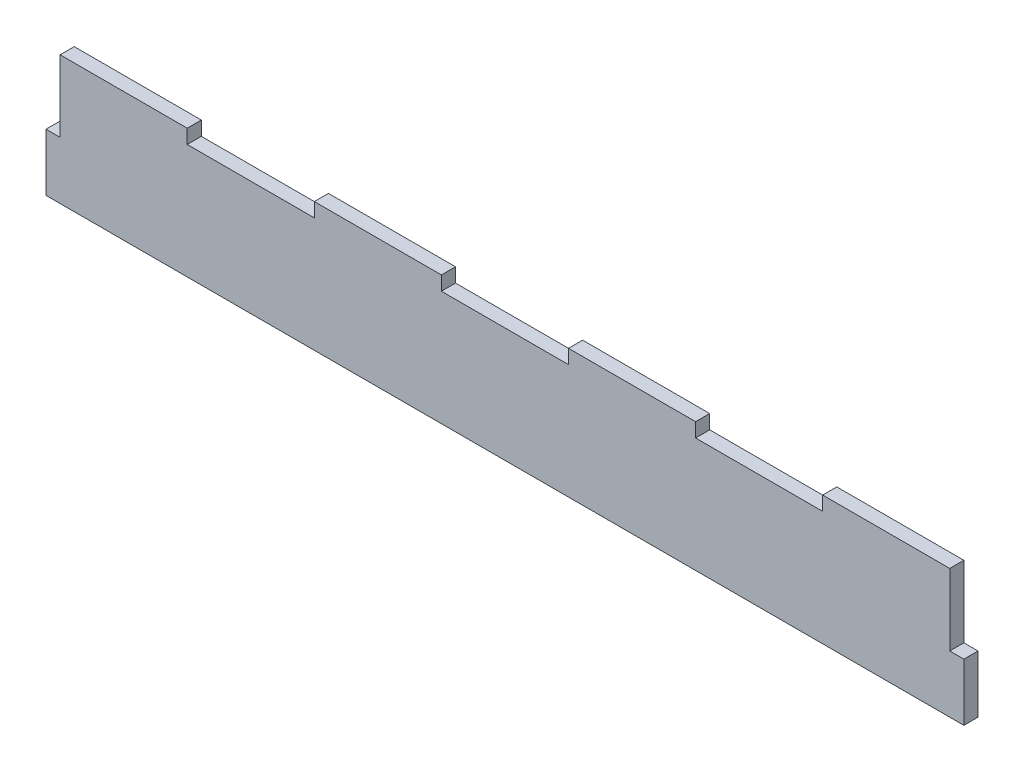
ISO-10303-21;
HEADER;
FILE_DESCRIPTION(('STEP AP214'),'2;1');
FILE_NAME('part.step','',(''),(''),'','','');
FILE_SCHEMA(('AUTOMOTIVE_DESIGN { 1 0 10303 214 1 1 1 1 }'));
ENDSEC;
DATA;
#1=APPLICATION_CONTEXT('core data for automotive mechanical design processes');
#2=APPLICATION_PROTOCOL_DEFINITION('international standard','automotive_design',2000,#1);
#3=PRODUCT_CONTEXT('',#1,'mechanical');
#4=PRODUCT('Part','Part','',(#3));
#5=PRODUCT_RELATED_PRODUCT_CATEGORY('part','',(#4));
#6=PRODUCT_DEFINITION_FORMATION('','',#4);
#7=PRODUCT_DEFINITION_CONTEXT('part definition',#1,'design');
#8=PRODUCT_DEFINITION('design','',#6,#7);
#9=PRODUCT_DEFINITION_SHAPE('','',#8);
#10=(LENGTH_UNIT() NAMED_UNIT(*) SI_UNIT(.MILLI.,.METRE.));
#11=(NAMED_UNIT(*) PLANE_ANGLE_UNIT() SI_UNIT($,.RADIAN.));
#12=(NAMED_UNIT(*) SI_UNIT($,.STERADIAN.) SOLID_ANGLE_UNIT());
#13=UNCERTAINTY_MEASURE_WITH_UNIT(LENGTH_MEASURE(1.E-05),#10,'distance_accuracy_value','');
#14=(GEOMETRIC_REPRESENTATION_CONTEXT(3) GLOBAL_UNCERTAINTY_ASSIGNED_CONTEXT((#13)) GLOBAL_UNIT_ASSIGNED_CONTEXT((#10,
#11,#12)) REPRESENTATION_CONTEXT('',''));
#15=CARTESIAN_POINT('',(0.,0.,0.));
#16=DIRECTION('',(0.,0.,1.));
#17=DIRECTION('',(1.,0.,0.));
#18=AXIS2_PLACEMENT_3D('',#15,#16,#17);
#19=CARTESIAN_POINT('',(0.,-10.16,10.16));
#20=DIRECTION('',(0.,1.,0.));
#21=DIRECTION('',(-1.,0.,0.));
#22=AXIS2_PLACEMENT_3D('',#19,#20,#21);
#23=PLANE('',#22);
#24=DIRECTION('',(1.,0.,0.));
#25=VECTOR('',#24,1.);
#26=CARTESIAN_POINT('',(0.,-10.16,0.));
#27=LINE('',#26,#25);
#28=CARTESIAN_POINT('',(101.6,-10.16,0.));
#29=VERTEX_POINT('',#28);
#30=CARTESIAN_POINT('',(193.04,-10.16,0.));
#31=VERTEX_POINT('',#30);
#32=EDGE_CURVE('E202',#29,#31,#27,.T.);
#33=ORIENTED_EDGE('',*,*,#32,.F.);
#34=DIRECTION('',(0.,0.,-1.));
#35=VECTOR('',#34,1.);
#36=CARTESIAN_POINT('',(101.6,-10.16,10.16));
#37=LINE('',#36,#35);
#38=CARTESIAN_POINT('',(101.6,-10.16,10.16));
#39=VERTEX_POINT('',#38);
#40=EDGE_CURVE('E11',#39,#29,#37,.T.);
#41=ORIENTED_EDGE('',*,*,#40,.F.);
#42=DIRECTION('',(1.,0.,0.));
#43=VECTOR('',#42,1.);
#44=CARTESIAN_POINT('',(0.,-10.16,10.16));
#45=LINE('',#44,#43);
#46=CARTESIAN_POINT('',(193.04,-10.16,10.16));
#47=VERTEX_POINT('',#46);
#48=EDGE_CURVE('E253',#39,#47,#45,.T.);
#49=ORIENTED_EDGE('',*,*,#48,.T.);
#50=DIRECTION('',(0.,0.,-1.));
#51=VECTOR('',#50,1.);
#52=CARTESIAN_POINT('',(193.04,-10.16,10.16));
#53=LINE('',#52,#51);
#54=EDGE_CURVE('E52',#47,#31,#53,.T.);
#55=ORIENTED_EDGE('',*,*,#54,.T.);
#56=EDGE_LOOP('',(#33,#41,#49,#55));
#57=FACE_BOUND('',#56,.T.);
#58=ADVANCED_FACE('F35',(#57),#23,.T.);
#59=CARTESIAN_POINT('',(101.6,0.,10.16));
#60=DIRECTION('',(-1.,0.,0.));
#61=DIRECTION('',(0.,0.,1.));
#62=AXIS2_PLACEMENT_3D('',#59,#60,#61);
#63=PLANE('',#62);
#64=DIRECTION('',(0.,1.,0.));
#65=VECTOR('',#64,1.);
#66=CARTESIAN_POINT('',(101.6,0.,0.));
#67=LINE('',#66,#65);
#68=CARTESIAN_POINT('',(101.6,0.,0.));
#69=VERTEX_POINT('',#68);
#70=EDGE_CURVE('E204',#29,#69,#67,.T.);
#71=ORIENTED_EDGE('',*,*,#70,.T.);
#72=DIRECTION('',(0.,0.,-1.));
#73=VECTOR('',#72,1.);
#74=CARTESIAN_POINT('',(101.6,0.,10.16));
#75=LINE('',#74,#73);
#76=CARTESIAN_POINT('',(101.6,0.,10.16));
#77=VERTEX_POINT('',#76);
#78=EDGE_CURVE('E44',#77,#69,#75,.T.);
#79=ORIENTED_EDGE('',*,*,#78,.F.);
#80=DIRECTION('',(0.,1.,0.));
#81=VECTOR('',#80,1.);
#82=CARTESIAN_POINT('',(101.6,0.,10.16));
#83=LINE('',#82,#81);
#84=EDGE_CURVE('E306',#39,#77,#83,.T.);
#85=ORIENTED_EDGE('',*,*,#84,.F.);
#86=ORIENTED_EDGE('',*,*,#40,.T.);
#87=EDGE_LOOP('',(#71,#79,#85,#86));
#88=FACE_BOUND('',#87,.T.);
#89=ADVANCED_FACE('F37',(#88),#63,.F.);
#90=CARTESIAN_POINT('',(0.,0.,10.16));
#91=DIRECTION('',(0.,1.,0.));
#92=DIRECTION('',(0.,0.,1.));
#93=AXIS2_PLACEMENT_3D('',#90,#91,#92);
#94=PLANE('',#93);
#95=DIRECTION('',(1.,0.,0.));
#96=VECTOR('',#95,1.);
#97=CARTESIAN_POINT('',(0.,0.,0.));
#98=LINE('',#97,#96);
#99=CARTESIAN_POINT('',(10.16,0.,0.));
#100=VERTEX_POINT('',#99);
#101=EDGE_CURVE('E209',#100,#69,#98,.T.);
#102=ORIENTED_EDGE('',*,*,#101,.F.);
#103=DIRECTION('',(0.,0.,-1.));
#104=VECTOR('',#103,1.);
#105=CARTESIAN_POINT('',(10.16,0.,10.16));
#106=LINE('',#105,#104);
#107=CARTESIAN_POINT('',(10.16,0.,10.16));
#108=VERTEX_POINT('',#107);
#109=EDGE_CURVE('E284',#108,#100,#106,.T.);
#110=ORIENTED_EDGE('',*,*,#109,.F.);
#111=DIRECTION('',(1.,0.,0.));
#112=VECTOR('',#111,1.);
#113=CARTESIAN_POINT('',(0.,0.,10.16));
#114=LINE('',#113,#112);
#115=EDGE_CURVE('E291',#108,#77,#114,.T.);
#116=ORIENTED_EDGE('',*,*,#115,.T.);
#117=ORIENTED_EDGE('',*,*,#78,.T.);
#118=EDGE_LOOP('',(#102,#110,#116,#117));
#119=FACE_BOUND('',#118,.T.);
#120=ADVANCED_FACE('F289',(#119),#94,.T.);
#121=CARTESIAN_POINT('',(10.16,0.,10.16));
#122=DIRECTION('',(-1.,0.,0.));
#123=DIRECTION('',(0.,0.,1.));
#124=AXIS2_PLACEMENT_3D('',#121,#122,#123);
#125=PLANE('',#124);
#126=DIRECTION('',(0.,1.,0.));
#127=VECTOR('',#126,1.);
#128=CARTESIAN_POINT('',(10.16,0.,0.));
#129=LINE('',#128,#127);
#130=CARTESIAN_POINT('',(10.16,-51.4350000000001,0.));
#131=VERTEX_POINT('',#130);
#132=EDGE_CURVE('E212',#131,#100,#129,.T.);
#133=ORIENTED_EDGE('',*,*,#132,.F.);
#134=DIRECTION('',(0.,0.,-1.));
#135=VECTOR('',#134,1.);
#136=CARTESIAN_POINT('',(10.16,-51.4350000000001,10.16));
#137=LINE('',#136,#135);
#138=CARTESIAN_POINT('',(10.16,-51.4350000000001,10.16));
#139=VERTEX_POINT('',#138);
#140=EDGE_CURVE('E282',#139,#131,#137,.T.);
#141=ORIENTED_EDGE('',*,*,#140,.F.);
#142=DIRECTION('',(0.,1.,0.));
#143=VECTOR('',#142,1.);
#144=CARTESIAN_POINT('',(10.16,0.,10.16));
#145=LINE('',#144,#143);
#146=EDGE_CURVE('E303',#139,#108,#145,.T.);
#147=ORIENTED_EDGE('',*,*,#146,.T.);
#148=ORIENTED_EDGE('',*,*,#109,.T.);
#149=EDGE_LOOP('',(#133,#141,#147,#148));
#150=FACE_BOUND('',#149,.T.);
#151=ADVANCED_FACE('F300',(#150),#125,.T.);
#152=CARTESIAN_POINT('',(0.,-51.4350000000001,10.16));
#153=DIRECTION('',(0.,1.,0.));
#154=DIRECTION('',(0.,0.,1.));
#155=AXIS2_PLACEMENT_3D('',#152,#153,#154);
#156=PLANE('',#155);
#157=DIRECTION('',(1.,0.,0.));
#158=VECTOR('',#157,1.);
#159=CARTESIAN_POINT('',(0.,-51.4350000000001,0.));
#160=LINE('',#159,#158);
#161=CARTESIAN_POINT('',(0.,-51.4350000000001,0.));
#162=VERTEX_POINT('',#161);
#163=EDGE_CURVE('E215',#162,#131,#160,.T.);
#164=ORIENTED_EDGE('',*,*,#163,.F.);
#165=DIRECTION('',(0.,0.,-1.));
#166=VECTOR('',#165,1.);
#167=CARTESIAN_POINT('',(0.,-51.4350000000001,10.16));
#168=LINE('',#167,#166);
#169=CARTESIAN_POINT('',(0.,-51.4350000000001,10.16));
#170=VERTEX_POINT('',#169);
#171=EDGE_CURVE('E280',#170,#162,#168,.T.);
#172=ORIENTED_EDGE('',*,*,#171,.F.);
#173=DIRECTION('',(1.,0.,0.));
#174=VECTOR('',#173,1.);
#175=CARTESIAN_POINT('',(0.,-51.4350000000001,10.16));
#176=LINE('',#175,#174);
#177=EDGE_CURVE('E308',#170,#139,#176,.T.);
#178=ORIENTED_EDGE('',*,*,#177,.T.);
#179=ORIENTED_EDGE('',*,*,#140,.T.);
#180=EDGE_LOOP('',(#164,#172,#178,#179));
#181=FACE_BOUND('',#180,.T.);
#182=ADVANCED_FACE('F410',(#181),#156,.T.);
#183=CARTESIAN_POINT('',(0.,0.,10.16));
#184=DIRECTION('',(1.,0.,0.));
#185=DIRECTION('',(0.,1.,0.));
#186=AXIS2_PLACEMENT_3D('',#183,#184,#185);
#187=PLANE('',#186);
#188=DIRECTION('',(0.,-1.,0.));
#189=VECTOR('',#188,1.);
#190=CARTESIAN_POINT('',(0.,0.,0.));
#191=LINE('',#190,#189);
#192=CARTESIAN_POINT('',(0.,-92.71,0.));
#193=VERTEX_POINT('',#192);
#194=EDGE_CURVE('E218',#162,#193,#191,.T.);
#195=ORIENTED_EDGE('',*,*,#194,.T.);
#196=DIRECTION('',(0.,0.,-1.));
#197=VECTOR('',#196,1.);
#198=CARTESIAN_POINT('',(0.,-92.71,10.16));
#199=LINE('',#198,#197);
#200=CARTESIAN_POINT('',(0.,-92.71,10.16));
#201=VERTEX_POINT('',#200);
#202=EDGE_CURVE('E277',#201,#193,#199,.T.);
#203=ORIENTED_EDGE('',*,*,#202,.F.);
#204=DIRECTION('',(0.,-1.,0.));
#205=VECTOR('',#204,1.);
#206=CARTESIAN_POINT('',(0.,0.,10.16));
#207=LINE('',#206,#205);
#208=EDGE_CURVE('E314',#170,#201,#207,.T.);
#209=ORIENTED_EDGE('',*,*,#208,.F.);
#210=ORIENTED_EDGE('',*,*,#171,.T.);
#211=EDGE_LOOP('',(#195,#203,#209,#210));
#212=FACE_BOUND('',#211,.T.);
#213=ADVANCED_FACE('F408',(#212),#187,.F.);
#214=CARTESIAN_POINT('',(0.,-92.71,10.16));
#215=DIRECTION('',(0.,1.,0.));
#216=DIRECTION('',(0.,0.,1.));
#217=AXIS2_PLACEMENT_3D('',#214,#215,#216);
#218=PLANE('',#217);
#219=DIRECTION('',(1.,0.,0.));
#220=VECTOR('',#219,1.);
#221=CARTESIAN_POINT('',(0.,-92.71,0.));
#222=LINE('',#221,#220);
#223=CARTESIAN_POINT('',(660.4,-92.71,0.));
#224=VERTEX_POINT('',#223);
#225=EDGE_CURVE('E220',#193,#224,#222,.T.);
#226=ORIENTED_EDGE('',*,*,#225,.T.);
#227=DIRECTION('',(0.,0.,-1.));
#228=VECTOR('',#227,1.);
#229=CARTESIAN_POINT('',(660.4,-92.71,10.16));
#230=LINE('',#229,#228);
#231=CARTESIAN_POINT('',(660.4,-92.71,10.16));
#232=VERTEX_POINT('',#231);
#233=EDGE_CURVE('E275',#232,#224,#230,.T.);
#234=ORIENTED_EDGE('',*,*,#233,.F.);
#235=DIRECTION('',(1.,0.,0.));
#236=VECTOR('',#235,1.);
#237=CARTESIAN_POINT('',(0.,-92.71,10.16));
#238=LINE('',#237,#236);
#239=EDGE_CURVE('E316',#201,#232,#238,.T.);
#240=ORIENTED_EDGE('',*,*,#239,.F.);
#241=ORIENTED_EDGE('',*,*,#202,.T.);
#242=EDGE_LOOP('',(#226,#234,#240,#241));
#243=FACE_BOUND('',#242,.T.);
#244=ADVANCED_FACE('F403',(#243),#218,.F.);
#245=CARTESIAN_POINT('',(660.4,-7.90843798363125E-13,10.16));
#246=DIRECTION('',(1.,0.,0.));
#247=DIRECTION('',(0.,1.,0.));
#248=AXIS2_PLACEMENT_3D('',#245,#246,#247);
#249=PLANE('',#248);
#250=DIRECTION('',(0.,-1.,0.));
#251=VECTOR('',#250,1.);
#252=CARTESIAN_POINT('',(660.4,-7.90843798363125E-13,0.));
#253=LINE('',#252,#251);
#254=CARTESIAN_POINT('',(660.4,-51.435,0.));
#255=VERTEX_POINT('',#254);
#256=EDGE_CURVE('E223',#255,#224,#253,.T.);
#257=ORIENTED_EDGE('',*,*,#256,.F.);
#258=DIRECTION('',(0.,0.,-1.));
#259=VECTOR('',#258,1.);
#260=CARTESIAN_POINT('',(660.4,-51.435,10.16));
#261=LINE('',#260,#259);
#262=CARTESIAN_POINT('',(660.4,-51.435,10.16));
#263=VERTEX_POINT('',#262);
#264=EDGE_CURVE('E273',#263,#255,#261,.T.);
#265=ORIENTED_EDGE('',*,*,#264,.F.);
#266=DIRECTION('',(0.,-1.,0.));
#267=VECTOR('',#266,1.);
#268=CARTESIAN_POINT('',(660.4,-7.90843798363125E-13,10.16));
#269=LINE('',#268,#267);
#270=EDGE_CURVE('E318',#263,#232,#269,.T.);
#271=ORIENTED_EDGE('',*,*,#270,.T.);
#272=ORIENTED_EDGE('',*,*,#233,.T.);
#273=EDGE_LOOP('',(#257,#265,#271,#272));
#274=FACE_BOUND('',#273,.T.);
#275=ADVANCED_FACE('F399',(#274),#249,.T.);
#276=CARTESIAN_POINT('',(0.,-51.4350000000004,10.16));
#277=DIRECTION('',(0.,-1.,0.));
#278=DIRECTION('',(1.,0.,0.));
#279=AXIS2_PLACEMENT_3D('',#276,#277,#278);
#280=PLANE('',#279);
#281=DIRECTION('',(-1.,0.,0.));
#282=VECTOR('',#281,1.);
#283=CARTESIAN_POINT('',(0.,-51.4350000000004,0.));
#284=LINE('',#283,#282);
#285=CARTESIAN_POINT('',(650.24,-51.435,0.));
#286=VERTEX_POINT('',#285);
#287=EDGE_CURVE('E226',#255,#286,#284,.T.);
#288=ORIENTED_EDGE('',*,*,#287,.T.);
#289=DIRECTION('',(0.,0.,-1.));
#290=VECTOR('',#289,1.);
#291=CARTESIAN_POINT('',(650.24,-51.435,10.16));
#292=LINE('',#291,#290);
#293=CARTESIAN_POINT('',(650.24,-51.435,10.16));
#294=VERTEX_POINT('',#293);
#295=EDGE_CURVE('E271',#294,#286,#292,.T.);
#296=ORIENTED_EDGE('',*,*,#295,.F.);
#297=DIRECTION('',(-1.,0.,0.));
#298=VECTOR('',#297,1.);
#299=CARTESIAN_POINT('',(0.,-51.4350000000004,10.16));
#300=LINE('',#299,#298);
#301=EDGE_CURVE('E321',#263,#294,#300,.T.);
#302=ORIENTED_EDGE('',*,*,#301,.F.);
#303=ORIENTED_EDGE('',*,*,#264,.T.);
#304=EDGE_LOOP('',(#288,#296,#302,#303));
#305=FACE_BOUND('',#304,.T.);
#306=ADVANCED_FACE('F396',(#305),#280,.F.);
#307=CARTESIAN_POINT('',(650.24,0.,10.16));
#308=DIRECTION('',(1.,0.,0.));
#309=DIRECTION('',(0.,0.,-1.));
#310=AXIS2_PLACEMENT_3D('',#307,#308,#309);
#311=PLANE('',#310);
#312=DIRECTION('',(0.,-1.,0.));
#313=VECTOR('',#312,1.);
#314=CARTESIAN_POINT('',(650.24,0.,0.));
#315=LINE('',#314,#313);
#316=CARTESIAN_POINT('',(650.24,0.,0.));
#317=VERTEX_POINT('',#316);
#318=EDGE_CURVE('E229',#317,#286,#315,.T.);
#319=ORIENTED_EDGE('',*,*,#318,.F.);
#320=DIRECTION('',(0.,0.,-1.));
#321=VECTOR('',#320,1.);
#322=CARTESIAN_POINT('',(650.24,0.,10.16));
#323=LINE('',#322,#321);
#324=CARTESIAN_POINT('',(650.24,0.,10.16));
#325=VERTEX_POINT('',#324);
#326=EDGE_CURVE('E269',#325,#317,#323,.T.);
#327=ORIENTED_EDGE('',*,*,#326,.F.);
#328=DIRECTION('',(0.,-1.,0.));
#329=VECTOR('',#328,1.);
#330=CARTESIAN_POINT('',(650.24,0.,10.16));
#331=LINE('',#330,#329);
#332=EDGE_CURVE('E323',#325,#294,#331,.T.);
#333=ORIENTED_EDGE('',*,*,#332,.T.);
#334=ORIENTED_EDGE('',*,*,#295,.T.);
#335=EDGE_LOOP('',(#319,#327,#333,#334));
#336=FACE_BOUND('',#335,.T.);
#337=ADVANCED_FACE('F391',(#336),#311,.T.);
#338=CARTESIAN_POINT('',(0.,0.,10.16));
#339=DIRECTION('',(0.,1.,0.));
#340=DIRECTION('',(0.,0.,1.));
#341=AXIS2_PLACEMENT_3D('',#338,#339,#340);
#342=PLANE('',#341);
#343=DIRECTION('',(1.,0.,0.));
#344=VECTOR('',#343,1.);
#345=CARTESIAN_POINT('',(0.,0.,0.));
#346=LINE('',#345,#344);
#347=CARTESIAN_POINT('',(558.8,0.,0.));
#348=VERTEX_POINT('',#347);
#349=EDGE_CURVE('E232',#348,#317,#346,.T.);
#350=ORIENTED_EDGE('',*,*,#349,.F.);
#351=DIRECTION('',(0.,0.,-1.));
#352=VECTOR('',#351,1.);
#353=CARTESIAN_POINT('',(558.8,0.,10.16));
#354=LINE('',#353,#352);
#355=CARTESIAN_POINT('',(558.8,0.,10.16));
#356=VERTEX_POINT('',#355);
#357=EDGE_CURVE('E267',#356,#348,#354,.T.);
#358=ORIENTED_EDGE('',*,*,#357,.F.);
#359=DIRECTION('',(1.,0.,0.));
#360=VECTOR('',#359,1.);
#361=CARTESIAN_POINT('',(0.,0.,10.16));
#362=LINE('',#361,#360);
#363=EDGE_CURVE('E326',#356,#325,#362,.T.);
#364=ORIENTED_EDGE('',*,*,#363,.T.);
#365=ORIENTED_EDGE('',*,*,#326,.T.);
#366=EDGE_LOOP('',(#350,#358,#364,#365));
#367=FACE_BOUND('',#366,.T.);
#368=ADVANCED_FACE('F386',(#367),#342,.T.);
#369=CARTESIAN_POINT('',(558.8,0.,10.16));
#370=DIRECTION('',(1.,0.,0.));
#371=DIRECTION('',(0.,0.,-1.));
#372=AXIS2_PLACEMENT_3D('',#369,#370,#371);
#373=PLANE('',#372);
#374=DIRECTION('',(0.,-1.,0.));
#375=VECTOR('',#374,1.);
#376=CARTESIAN_POINT('',(558.8,0.,0.));
#377=LINE('',#376,#375);
#378=CARTESIAN_POINT('',(558.8,-10.16,0.));
#379=VERTEX_POINT('',#378);
#380=EDGE_CURVE('E235',#348,#379,#377,.T.);
#381=ORIENTED_EDGE('',*,*,#380,.T.);
#382=DIRECTION('',(0.,0.,-1.));
#383=VECTOR('',#382,1.);
#384=CARTESIAN_POINT('',(558.8,-10.16,10.16));
#385=LINE('',#384,#383);
#386=CARTESIAN_POINT('',(558.8,-10.16,10.16));
#387=VERTEX_POINT('',#386);
#388=EDGE_CURVE('E265',#387,#379,#385,.T.);
#389=ORIENTED_EDGE('',*,*,#388,.F.);
#390=DIRECTION('',(0.,-1.,0.));
#391=VECTOR('',#390,1.);
#392=CARTESIAN_POINT('',(558.8,0.,10.16));
#393=LINE('',#392,#391);
#394=EDGE_CURVE('E329',#356,#387,#393,.T.);
#395=ORIENTED_EDGE('',*,*,#394,.F.);
#396=ORIENTED_EDGE('',*,*,#357,.T.);
#397=EDGE_LOOP('',(#381,#389,#395,#396));
#398=FACE_BOUND('',#397,.T.);
#399=ADVANCED_FACE('F362',(#398),#373,.F.);
#400=CARTESIAN_POINT('',(467.36,-10.16,0.));
#401=VERTEX_POINT('',#400);
#402=EDGE_CURVE('E206',#401,#379,#27,.T.);
#403=ORIENTED_EDGE('',*,*,#402,.F.);
#404=DIRECTION('',(0.,0.,-1.));
#405=VECTOR('',#404,1.);
#406=CARTESIAN_POINT('',(467.36,-10.16,10.16));
#407=LINE('',#406,#405);
#408=CARTESIAN_POINT('',(467.36,-10.16,10.16));
#409=VERTEX_POINT('',#408);
#410=EDGE_CURVE('E263',#409,#401,#407,.T.);
#411=ORIENTED_EDGE('',*,*,#410,.F.);
#412=EDGE_CURVE('E331',#409,#387,#45,.T.);
#413=ORIENTED_EDGE('',*,*,#412,.T.);
#414=ORIENTED_EDGE('',*,*,#388,.T.);
#415=EDGE_LOOP('',(#403,#411,#413,#414));
#416=FACE_BOUND('',#415,.T.);
#417=ADVANCED_FACE('F353',(#416),#23,.T.);
#418=CARTESIAN_POINT('',(467.36,0.,10.16));
#419=DIRECTION('',(-1.,0.,0.));
#420=DIRECTION('',(0.,0.,1.));
#421=AXIS2_PLACEMENT_3D('',#418,#419,#420);
#422=PLANE('',#421);
#423=DIRECTION('',(0.,1.,0.));
#424=VECTOR('',#423,1.);
#425=CARTESIAN_POINT('',(467.36,0.,0.));
#426=LINE('',#425,#424);
#427=CARTESIAN_POINT('',(467.36,0.,0.));
#428=VERTEX_POINT('',#427);
#429=EDGE_CURVE('E238',#401,#428,#426,.T.);
#430=ORIENTED_EDGE('',*,*,#429,.T.);
#431=DIRECTION('',(0.,0.,-1.));
#432=VECTOR('',#431,1.);
#433=CARTESIAN_POINT('',(467.36,0.,10.16));
#434=LINE('',#433,#432);
#435=CARTESIAN_POINT('',(467.36,0.,10.16));
#436=VERTEX_POINT('',#435);
#437=EDGE_CURVE('E261',#436,#428,#434,.T.);
#438=ORIENTED_EDGE('',*,*,#437,.F.);
#439=DIRECTION('',(0.,1.,0.));
#440=VECTOR('',#439,1.);
#441=CARTESIAN_POINT('',(467.36,0.,10.16));
#442=LINE('',#441,#440);
#443=EDGE_CURVE('E332',#409,#436,#442,.T.);
#444=ORIENTED_EDGE('',*,*,#443,.F.);
#445=ORIENTED_EDGE('',*,*,#410,.T.);
#446=EDGE_LOOP('',(#430,#438,#444,#445));
#447=FACE_BOUND('',#446,.T.);
#448=ADVANCED_FACE('F361',(#447),#422,.F.);
#449=CARTESIAN_POINT('',(0.,0.,10.16));
#450=DIRECTION('',(0.,1.,0.));
#451=DIRECTION('',(0.,0.,1.));
#452=AXIS2_PLACEMENT_3D('',#449,#450,#451);
#453=PLANE('',#452);
#454=DIRECTION('',(1.,0.,0.));
#455=VECTOR('',#454,1.);
#456=CARTESIAN_POINT('',(0.,0.,0.));
#457=LINE('',#456,#455);
#458=CARTESIAN_POINT('',(375.92,0.,0.));
#459=VERTEX_POINT('',#458);
#460=EDGE_CURVE('E241',#459,#428,#457,.T.);
#461=ORIENTED_EDGE('',*,*,#460,.F.);
#462=DIRECTION('',(0.,0.,-1.));
#463=VECTOR('',#462,1.);
#464=CARTESIAN_POINT('',(375.92,0.,10.16));
#465=LINE('',#464,#463);
#466=CARTESIAN_POINT('',(375.92,0.,10.16));
#467=VERTEX_POINT('',#466);
#468=EDGE_CURVE('E259',#467,#459,#465,.T.);
#469=ORIENTED_EDGE('',*,*,#468,.F.);
#470=DIRECTION('',(1.,0.,0.));
#471=VECTOR('',#470,1.);
#472=CARTESIAN_POINT('',(0.,0.,10.16));
#473=LINE('',#472,#471);
#474=EDGE_CURVE('E334',#467,#436,#473,.T.);
#475=ORIENTED_EDGE('',*,*,#474,.T.);
#476=ORIENTED_EDGE('',*,*,#437,.T.);
#477=EDGE_LOOP('',(#461,#469,#475,#476));
#478=FACE_BOUND('',#477,.T.);
#479=ADVANCED_FACE('F370',(#478),#453,.T.);
#480=CARTESIAN_POINT('',(375.92,0.,10.16));
#481=DIRECTION('',(-1.,0.,0.));
#482=DIRECTION('',(0.,0.,1.));
#483=AXIS2_PLACEMENT_3D('',#480,#481,#482);
#484=PLANE('',#483);
#485=DIRECTION('',(0.,1.,0.));
#486=VECTOR('',#485,1.);
#487=CARTESIAN_POINT('',(375.92,0.,0.));
#488=LINE('',#487,#486);
#489=CARTESIAN_POINT('',(375.92,-10.16,0.));
#490=VERTEX_POINT('',#489);
#491=EDGE_CURVE('E244',#490,#459,#488,.T.);
#492=ORIENTED_EDGE('',*,*,#491,.F.);
#493=DIRECTION('',(0.,0.,-1.));
#494=VECTOR('',#493,1.);
#495=CARTESIAN_POINT('',(375.92,-10.16,10.16));
#496=LINE('',#495,#494);
#497=CARTESIAN_POINT('',(375.92,-10.16,10.16));
#498=VERTEX_POINT('',#497);
#499=EDGE_CURVE('E257',#498,#490,#496,.T.);
#500=ORIENTED_EDGE('',*,*,#499,.F.);
#501=DIRECTION('',(0.,1.,0.));
#502=VECTOR('',#501,1.);
#503=CARTESIAN_POINT('',(375.92,0.,10.16));
#504=LINE('',#503,#502);
#505=EDGE_CURVE('E336',#498,#467,#504,.T.);
#506=ORIENTED_EDGE('',*,*,#505,.T.);
#507=ORIENTED_EDGE('',*,*,#468,.T.);
#508=EDGE_LOOP('',(#492,#500,#506,#507));
#509=FACE_BOUND('',#508,.T.);
#510=ADVANCED_FACE('F365',(#509),#484,.T.);
#511=CARTESIAN_POINT('',(284.48,-10.16,0.));
#512=VERTEX_POINT('',#511);
#513=EDGE_CURVE('E205',#512,#490,#27,.T.);
#514=ORIENTED_EDGE('',*,*,#513,.F.);
#515=DIRECTION('',(0.,0.,-1.));
#516=VECTOR('',#515,1.);
#517=CARTESIAN_POINT('',(284.48,-10.16,10.16));
#518=LINE('',#517,#516);
#519=CARTESIAN_POINT('',(284.48,-10.16,10.16));
#520=VERTEX_POINT('',#519);
#521=EDGE_CURVE('E183',#520,#512,#518,.T.);
#522=ORIENTED_EDGE('',*,*,#521,.F.);
#523=EDGE_CURVE('E194',#520,#498,#45,.T.);
#524=ORIENTED_EDGE('',*,*,#523,.T.);
#525=ORIENTED_EDGE('',*,*,#499,.T.);
#526=EDGE_LOOP('',(#514,#522,#524,#525));
#527=FACE_BOUND('',#526,.T.);
#528=ADVANCED_FACE('F354',(#527),#23,.T.);
#529=CARTESIAN_POINT('',(284.48,0.,10.16));
#530=DIRECTION('',(1.,0.,0.));
#531=DIRECTION('',(0.,0.,-1.));
#532=AXIS2_PLACEMENT_3D('',#529,#530,#531);
#533=PLANE('',#532);
#534=DIRECTION('',(0.,-1.,0.));
#535=VECTOR('',#534,1.);
#536=CARTESIAN_POINT('',(284.48,0.,0.));
#537=LINE('',#536,#535);
#538=CARTESIAN_POINT('',(284.48,0.,0.));
#539=VERTEX_POINT('',#538);
#540=EDGE_CURVE('E179',#539,#512,#537,.T.);
#541=ORIENTED_EDGE('',*,*,#540,.F.);
#542=DIRECTION('',(0.,0.,-1.));
#543=VECTOR('',#542,1.);
#544=CARTESIAN_POINT('',(284.48,0.,10.16));
#545=LINE('',#544,#543);
#546=CARTESIAN_POINT('',(284.48,0.,10.16));
#547=VERTEX_POINT('',#546);
#548=EDGE_CURVE('E174',#547,#539,#545,.T.);
#549=ORIENTED_EDGE('',*,*,#548,.F.);
#550=DIRECTION('',(0.,-1.,0.));
#551=VECTOR('',#550,1.);
#552=CARTESIAN_POINT('',(284.48,0.,10.16));
#553=LINE('',#552,#551);
#554=EDGE_CURVE('E177',#547,#520,#553,.T.);
#555=ORIENTED_EDGE('',*,*,#554,.T.);
#556=ORIENTED_EDGE('',*,*,#521,.T.);
#557=EDGE_LOOP('',(#541,#549,#555,#556));
#558=FACE_BOUND('',#557,.T.);
#559=ADVANCED_FACE('F176',(#558),#533,.T.);
#560=CARTESIAN_POINT('',(0.,0.,10.16));
#561=DIRECTION('',(0.,1.,0.));
#562=DIRECTION('',(0.,0.,1.));
#563=AXIS2_PLACEMENT_3D('',#560,#561,#562);
#564=PLANE('',#563);
#565=DIRECTION('',(1.,0.,0.));
#566=VECTOR('',#565,1.);
#567=CARTESIAN_POINT('',(0.,0.,0.));
#568=LINE('',#567,#566);
#569=CARTESIAN_POINT('',(193.04,0.,0.));
#570=VERTEX_POINT('',#569);
#571=EDGE_CURVE('E248',#570,#539,#568,.T.);
#572=ORIENTED_EDGE('',*,*,#571,.F.);
#573=DIRECTION('',(0.,0.,-1.));
#574=VECTOR('',#573,1.);
#575=CARTESIAN_POINT('',(193.04,0.,10.16));
#576=LINE('',#575,#574);
#577=CARTESIAN_POINT('',(193.04,0.,10.16));
#578=VERTEX_POINT('',#577);
#579=EDGE_CURVE('E113',#578,#570,#576,.T.);
#580=ORIENTED_EDGE('',*,*,#579,.F.);
#581=DIRECTION('',(1.,0.,0.));
#582=VECTOR('',#581,1.);
#583=CARTESIAN_POINT('',(0.,0.,10.16));
#584=LINE('',#583,#582);
#585=EDGE_CURVE('E191',#578,#547,#584,.T.);
#586=ORIENTED_EDGE('',*,*,#585,.T.);
#587=ORIENTED_EDGE('',*,*,#548,.T.);
#588=EDGE_LOOP('',(#572,#580,#586,#587));
#589=FACE_BOUND('',#588,.T.);
#590=ADVANCED_FACE('F196',(#589),#564,.T.);
#591=CARTESIAN_POINT('',(193.04,0.,10.16));
#592=DIRECTION('',(-1.,0.,0.));
#593=DIRECTION('',(0.,0.,1.));
#594=AXIS2_PLACEMENT_3D('',#591,#592,#593);
#595=PLANE('',#594);
#596=DIRECTION('',(0.,1.,0.));
#597=VECTOR('',#596,1.);
#598=CARTESIAN_POINT('',(193.04,0.,0.));
#599=LINE('',#598,#597);
#600=EDGE_CURVE('E250',#31,#570,#599,.T.);
#601=ORIENTED_EDGE('',*,*,#600,.F.);
#602=ORIENTED_EDGE('',*,*,#54,.F.);
#603=DIRECTION('',(0.,1.,0.));
#604=VECTOR('',#603,1.);
#605=CARTESIAN_POINT('',(193.04,0.,10.16));
#606=LINE('',#605,#604);
#607=EDGE_CURVE('E197',#47,#578,#606,.T.);
#608=ORIENTED_EDGE('',*,*,#607,.T.);
#609=ORIENTED_EDGE('',*,*,#579,.T.);
#610=EDGE_LOOP('',(#601,#602,#608,#609));
#611=FACE_BOUND('',#610,.T.);
#612=ADVANCED_FACE('F341',(#611),#595,.T.);
#613=CARTESIAN_POINT('',(0.,0.,10.16));
#614=DIRECTION('',(0.,0.,1.));
#615=DIRECTION('',(1.,0.,0.));
#616=AXIS2_PLACEMENT_3D('',#613,#614,#615);
#617=PLANE('',#616);
#618=ORIENTED_EDGE('',*,*,#48,.F.);
#619=ORIENTED_EDGE('',*,*,#84,.T.);
#620=ORIENTED_EDGE('',*,*,#115,.F.);
#621=ORIENTED_EDGE('',*,*,#146,.F.);
#622=ORIENTED_EDGE('',*,*,#177,.F.);
#623=ORIENTED_EDGE('',*,*,#208,.T.);
#624=ORIENTED_EDGE('',*,*,#239,.T.);
#625=ORIENTED_EDGE('',*,*,#270,.F.);
#626=ORIENTED_EDGE('',*,*,#301,.T.);
#627=ORIENTED_EDGE('',*,*,#332,.F.);
#628=ORIENTED_EDGE('',*,*,#363,.F.);
#629=ORIENTED_EDGE('',*,*,#394,.T.);
#630=ORIENTED_EDGE('',*,*,#412,.F.);
#631=ORIENTED_EDGE('',*,*,#443,.T.);
#632=ORIENTED_EDGE('',*,*,#474,.F.);
#633=ORIENTED_EDGE('',*,*,#505,.F.);
#634=ORIENTED_EDGE('',*,*,#523,.F.);
#635=ORIENTED_EDGE('',*,*,#554,.F.);
#636=ORIENTED_EDGE('',*,*,#585,.F.);
#637=ORIENTED_EDGE('',*,*,#607,.F.);
#638=EDGE_LOOP('',(#618,#619,#620,#621,#622,#623,#624,#625,#626,#627,#628,#629,#630,#631,#632,
#633,#634,#635,#636,#637));
#639=FACE_BOUND('',#638,.T.);
#640=ADVANCED_FACE('F189',(#639),#617,.T.);
#641=CARTESIAN_POINT('',(0.,0.,0.));
#642=DIRECTION('',(0.,0.,1.));
#643=DIRECTION('',(1.,0.,0.));
#644=AXIS2_PLACEMENT_3D('',#641,#642,#643);
#645=PLANE('',#644);
#646=ORIENTED_EDGE('',*,*,#32,.T.);
#647=ORIENTED_EDGE('',*,*,#600,.T.);
#648=ORIENTED_EDGE('',*,*,#571,.T.);
#649=ORIENTED_EDGE('',*,*,#540,.T.);
#650=ORIENTED_EDGE('',*,*,#513,.T.);
#651=ORIENTED_EDGE('',*,*,#491,.T.);
#652=ORIENTED_EDGE('',*,*,#460,.T.);
#653=ORIENTED_EDGE('',*,*,#429,.F.);
#654=ORIENTED_EDGE('',*,*,#402,.T.);
#655=ORIENTED_EDGE('',*,*,#380,.F.);
#656=ORIENTED_EDGE('',*,*,#349,.T.);
#657=ORIENTED_EDGE('',*,*,#318,.T.);
#658=ORIENTED_EDGE('',*,*,#287,.F.);
#659=ORIENTED_EDGE('',*,*,#256,.T.);
#660=ORIENTED_EDGE('',*,*,#225,.F.);
#661=ORIENTED_EDGE('',*,*,#194,.F.);
#662=ORIENTED_EDGE('',*,*,#163,.T.);
#663=ORIENTED_EDGE('',*,*,#132,.T.);
#664=ORIENTED_EDGE('',*,*,#101,.T.);
#665=ORIENTED_EDGE('',*,*,#70,.F.);
#666=EDGE_LOOP('',(#646,#647,#648,#649,#650,#651,#652,#653,#654,#655,#656,#657,#658,#659,#660,
#661,#662,#663,#664,#665));
#667=FACE_BOUND('',#666,.T.);
#668=ADVANCED_FACE('F295',(#667),#645,.F.);
#669=CLOSED_SHELL('',(#58,#89,#120,#151,#182,#213,#244,#275,#306,#337,#368,#399,#417,#448,#479,
#510,#528,#559,#590,#612,#640,#668));
#670=MANIFOLD_SOLID_BREP('B2',#669);
#671=ADVANCED_BREP_SHAPE_REPRESENTATION('',(#18,#670),#14);
#672=SHAPE_DEFINITION_REPRESENTATION(#9,#671);
ENDSEC;
END-ISO-10303-21;
